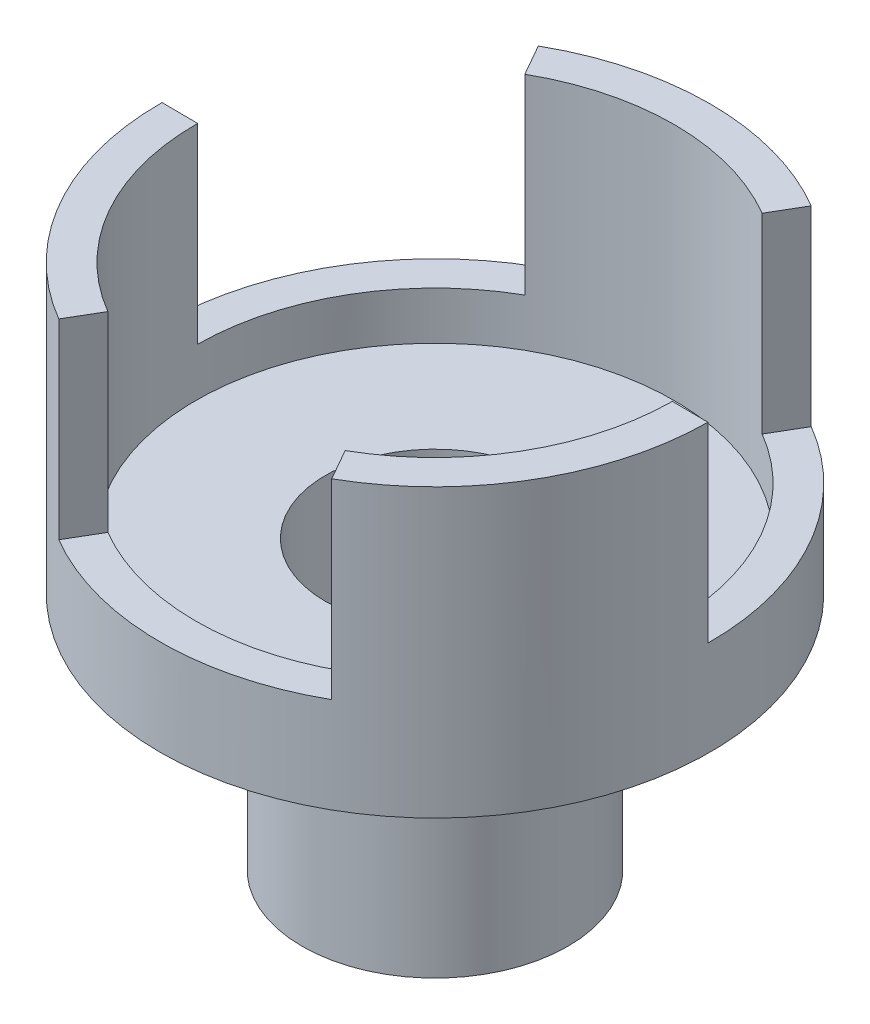
ISO-10303-21;
HEADER;
FILE_DESCRIPTION(('STEP AP214'),'2;1');
FILE_NAME('part.step','',(''),(''),'','','');
FILE_SCHEMA(('AUTOMOTIVE_DESIGN { 1 0 10303 214 1 1 1 1 }'));
ENDSEC;
DATA;
#1=APPLICATION_CONTEXT('core data for automotive mechanical design processes');
#2=APPLICATION_PROTOCOL_DEFINITION('international standard','automotive_design',2000,#1);
#3=PRODUCT_CONTEXT('',#1,'mechanical');
#4=PRODUCT('Part','Part','',(#3));
#5=PRODUCT_RELATED_PRODUCT_CATEGORY('part','',(#4));
#6=PRODUCT_DEFINITION_FORMATION('','',#4);
#7=PRODUCT_DEFINITION_CONTEXT('part definition',#1,'design');
#8=PRODUCT_DEFINITION('design','',#6,#7);
#9=PRODUCT_DEFINITION_SHAPE('','',#8);
#10=(LENGTH_UNIT() NAMED_UNIT(*) SI_UNIT(.MILLI.,.METRE.));
#11=(NAMED_UNIT(*) PLANE_ANGLE_UNIT() SI_UNIT($,.RADIAN.));
#12=(NAMED_UNIT(*) SI_UNIT($,.STERADIAN.) SOLID_ANGLE_UNIT());
#13=UNCERTAINTY_MEASURE_WITH_UNIT(LENGTH_MEASURE(1.E-05),#10,'distance_accuracy_value','');
#14=(GEOMETRIC_REPRESENTATION_CONTEXT(3) GLOBAL_UNCERTAINTY_ASSIGNED_CONTEXT((#13)) GLOBAL_UNIT_ASSIGNED_CONTEXT((#10,
#11,#12)) REPRESENTATION_CONTEXT('',''));
#15=CARTESIAN_POINT('',(0.,0.,0.));
#16=DIRECTION('',(0.,0.,1.));
#17=DIRECTION('',(1.,0.,0.));
#18=AXIS2_PLACEMENT_3D('',#15,#16,#17);
#19=CARTESIAN_POINT('',(0.,10.,0.));
#20=DIRECTION('',(0.,1.,0.));
#21=DIRECTION('',(0.,0.,1.));
#22=AXIS2_PLACEMENT_3D('',#19,#20,#21);
#23=PLANE('',#22);
#24=CARTESIAN_POINT('',(0.,10.,0.));
#25=DIRECTION('',(0.,1.,0.));
#26=DIRECTION('',(0.,0.,1.));
#27=AXIS2_PLACEMENT_3D('',#24,#25,#26);
#28=CIRCLE('',#27,11.5);
#29=CARTESIAN_POINT('',(5.67890834580028,10.,10.));
#30=VERTEX_POINT('',#29);
#31=CARTESIAN_POINT('',(11.4997082107445,10.,0.0819211067736286));
#32=VERTEX_POINT('',#31);
#33=EDGE_CURVE('E12',#30,#32,#28,.T.);
#34=ORIENTED_EDGE('',*,*,#33,.T.);
#35=DIRECTION('',(-0.999974627021263,0.,-0.00712357450205536));
#36=VECTOR('',#35,1.);
#37=CARTESIAN_POINT('',(11.4997082107445,10.,0.0819211067736286));
#38=LINE('',#37,#36);
#39=CARTESIAN_POINT('',(9.99974627021262,10.,0.0712357450205455));
#40=VERTEX_POINT('',#39);
#41=EDGE_CURVE('E217',#32,#40,#38,.T.);
#42=ORIENTED_EDGE('',*,*,#41,.T.);
#43=CARTESIAN_POINT('',(0.,10.,0.));
#44=DIRECTION('',(0.,1.,0.));
#45=DIRECTION('',(0.,0.,1.));
#46=AXIS2_PLACEMENT_3D('',#43,#44,#45);
#47=CIRCLE('',#46,10.);
#48=CARTESIAN_POINT('',(4.93818117026111,10.,8.69565217391304));
#49=VERTEX_POINT('',#48);
#50=EDGE_CURVE('E158',#49,#40,#47,.T.);
#51=ORIENTED_EDGE('',*,*,#50,.F.);
#52=DIRECTION('',(-0.493818117026111,0.,-0.869565217391304));
#53=VECTOR('',#52,1.);
#54=CARTESIAN_POINT('',(5.67890834580028,10.,10.));
#55=LINE('',#54,#53);
#56=EDGE_CURVE('E144',#30,#49,#55,.T.);
#57=ORIENTED_EDGE('',*,*,#56,.F.);
#58=EDGE_LOOP('',(#34,#42,#51,#57));
#59=FACE_BOUND('',#58,.T.);
#60=ADVANCED_FACE('F42',(#59),#23,.T.);
#61=CARTESIAN_POINT('',(-11.4997082107445,10.,-0.0819211067735505));
#62=VERTEX_POINT('',#61);
#63=CARTESIAN_POINT('',(-5.82079986494427,10.,9.91807889322649));
#64=VERTEX_POINT('',#63);
#65=EDGE_CURVE('E51',#62,#64,#28,.T.);
#66=ORIENTED_EDGE('',*,*,#65,.T.);
#67=DIRECTION('',(0.506156509995154,0.,-0.86244164288926));
#68=VECTOR('',#67,1.);
#69=CARTESIAN_POINT('',(-5.82079986494427,10.,9.91807889322649));
#70=LINE('',#69,#68);
#71=CARTESIAN_POINT('',(-5.06156509995154,10.,8.6244164288926));
#72=VERTEX_POINT('',#71);
#73=EDGE_CURVE('E133',#64,#72,#70,.T.);
#74=ORIENTED_EDGE('',*,*,#73,.T.);
#75=CARTESIAN_POINT('',(-9.99974627021263,10.,-0.0712357450204762));
#76=VERTEX_POINT('',#75);
#77=EDGE_CURVE('E163',#76,#72,#47,.T.);
#78=ORIENTED_EDGE('',*,*,#77,.F.);
#79=DIRECTION('',(0.999974627021263,0.,0.00712357450204785));
#80=VECTOR('',#79,1.);
#81=CARTESIAN_POINT('',(-11.4997082107445,10.,-0.0819211067735505));
#82=LINE('',#81,#80);
#83=EDGE_CURVE('E157',#62,#76,#82,.T.);
#84=ORIENTED_EDGE('',*,*,#83,.F.);
#85=EDGE_LOOP('',(#66,#74,#78,#84));
#86=FACE_BOUND('',#85,.T.);
#87=ADVANCED_FACE('F156',(#86),#23,.T.);
#88=DIRECTION('',(-0.50615650999516,0.,0.862441642889256));
#89=VECTOR('',#88,1.);
#90=CARTESIAN_POINT('',(5.82079986494434,10.,-9.91807889322645));
#91=LINE('',#90,#89);
#92=CARTESIAN_POINT('',(5.82079986494434,10.,-9.91807889322645));
#93=VERTEX_POINT('',#92);
#94=CARTESIAN_POINT('',(5.0615650999516,10.,-8.62441642889256));
#95=VERTEX_POINT('',#94);
#96=EDGE_CURVE('E153',#93,#95,#91,.T.);
#97=ORIENTED_EDGE('',*,*,#96,.F.);
#98=CARTESIAN_POINT('',(-5.67890834580021,10.,-10.));
#99=VERTEX_POINT('',#98);
#100=EDGE_CURVE('E50',#93,#99,#28,.T.);
#101=ORIENTED_EDGE('',*,*,#100,.T.);
#102=DIRECTION('',(0.493818117026104,0.,0.869565217391308));
#103=VECTOR('',#102,1.);
#104=CARTESIAN_POINT('',(-5.67890834580021,10.,-10.));
#105=LINE('',#104,#103);
#106=CARTESIAN_POINT('',(-4.93818117026105,10.,-8.69565217391307));
#107=VERTEX_POINT('',#106);
#108=EDGE_CURVE('E202',#99,#107,#105,.T.);
#109=ORIENTED_EDGE('',*,*,#108,.T.);
#110=EDGE_CURVE('E161',#95,#107,#47,.T.);
#111=ORIENTED_EDGE('',*,*,#110,.F.);
#112=EDGE_LOOP('',(#97,#101,#109,#111));
#113=FACE_BOUND('',#112,.T.);
#114=ADVANCED_FACE('F269',(#113),#23,.T.);
#115=CARTESIAN_POINT('',(0.,10.,0.));
#116=DIRECTION('',(0.,-1.,0.));
#117=DIRECTION('',(0.,0.,-1.));
#118=AXIS2_PLACEMENT_3D('',#115,#116,#117);
#119=CYLINDRICAL_SURFACE('',#118,11.5);
#120=CARTESIAN_POINT('',(0.,-2.,0.));
#121=DIRECTION('',(0.,-1.,0.));
#122=DIRECTION('',(0.,0.,-1.));
#123=AXIS2_PLACEMENT_3D('',#120,#121,#122);
#124=CIRCLE('',#123,11.5);
#125=CARTESIAN_POINT('',(0.,-2.,-11.5));
#126=VERTEX_POINT('',#125);
#127=EDGE_CURVE('E177',#126,#126,#124,.T.);
#128=ORIENTED_EDGE('',*,*,#127,.F.);
#129=EDGE_LOOP('',(#128));
#130=FACE_BOUND('',#129,.T.);
#131=DIRECTION('',(0.,1.,0.));
#132=VECTOR('',#131,1.);
#133=CARTESIAN_POINT('',(11.4997082107445,2.,0.0819211067736286));
#134=LINE('',#133,#132);
#135=CARTESIAN_POINT('',(11.4997082107445,2.,0.0819211067736286));
#136=VERTEX_POINT('',#135);
#137=EDGE_CURVE('E227',#136,#32,#134,.T.);
#138=ORIENTED_EDGE('',*,*,#137,.T.);
#139=ORIENTED_EDGE('',*,*,#33,.F.);
#140=DIRECTION('',(0.,1.,0.));
#141=VECTOR('',#140,1.);
#142=CARTESIAN_POINT('',(5.67890834580028,2.,10.));
#143=LINE('',#142,#141);
#144=CARTESIAN_POINT('',(5.67890834580028,2.,10.));
#145=VERTEX_POINT('',#144);
#146=EDGE_CURVE('E241',#145,#30,#143,.T.);
#147=ORIENTED_EDGE('',*,*,#146,.F.);
#148=CARTESIAN_POINT('',(0.,2.,0.));
#149=DIRECTION('',(0.,1.,0.));
#150=DIRECTION('',(0.,0.,1.));
#151=AXIS2_PLACEMENT_3D('',#148,#149,#150);
#152=CIRCLE('',#151,11.5);
#153=CARTESIAN_POINT('',(-5.82079986494427,2.,9.91807889322649));
#154=VERTEX_POINT('',#153);
#155=EDGE_CURVE('E145',#154,#145,#152,.T.);
#156=ORIENTED_EDGE('',*,*,#155,.F.);
#157=DIRECTION('',(0.,1.,0.));
#158=VECTOR('',#157,1.);
#159=CARTESIAN_POINT('',(-5.82079986494427,2.,9.91807889322649));
#160=LINE('',#159,#158);
#161=EDGE_CURVE('E136',#154,#64,#160,.T.);
#162=ORIENTED_EDGE('',*,*,#161,.T.);
#163=ORIENTED_EDGE('',*,*,#65,.F.);
#164=DIRECTION('',(0.,1.,0.));
#165=VECTOR('',#164,1.);
#166=CARTESIAN_POINT('',(-11.4997082107445,2.,-0.0819211067735505));
#167=LINE('',#166,#165);
#168=CARTESIAN_POINT('',(-11.4997082107445,2.,-0.0819211067735505));
#169=VERTEX_POINT('',#168);
#170=EDGE_CURVE('E193',#169,#62,#167,.T.);
#171=ORIENTED_EDGE('',*,*,#170,.F.);
#172=CARTESIAN_POINT('',(0.,2.,0.));
#173=DIRECTION('',(0.,1.,0.));
#174=DIRECTION('',(0.,0.,1.));
#175=AXIS2_PLACEMENT_3D('',#172,#173,#174);
#176=CIRCLE('',#175,11.5);
#177=CARTESIAN_POINT('',(-5.67890834580021,2.,-10.));
#178=VERTEX_POINT('',#177);
#179=EDGE_CURVE('E205',#178,#169,#176,.T.);
#180=ORIENTED_EDGE('',*,*,#179,.F.);
#181=DIRECTION('',(0.,1.,0.));
#182=VECTOR('',#181,1.);
#183=CARTESIAN_POINT('',(-5.67890834580021,2.,-10.));
#184=LINE('',#183,#182);
#185=EDGE_CURVE('E192',#178,#99,#184,.T.);
#186=ORIENTED_EDGE('',*,*,#185,.T.);
#187=ORIENTED_EDGE('',*,*,#100,.F.);
#188=DIRECTION('',(0.,1.,0.));
#189=VECTOR('',#188,1.);
#190=CARTESIAN_POINT('',(5.82079986494434,2.,-9.91807889322645));
#191=LINE('',#190,#189);
#192=CARTESIAN_POINT('',(5.82079986494434,2.,-9.91807889322645));
#193=VERTEX_POINT('',#192);
#194=EDGE_CURVE('E223',#193,#93,#191,.T.);
#195=ORIENTED_EDGE('',*,*,#194,.F.);
#196=CARTESIAN_POINT('',(0.,2.,0.));
#197=DIRECTION('',(0.,1.,0.));
#198=DIRECTION('',(0.,0.,1.));
#199=AXIS2_PLACEMENT_3D('',#196,#197,#198);
#200=CIRCLE('',#199,11.5);
#201=EDGE_CURVE('E215',#136,#193,#200,.T.);
#202=ORIENTED_EDGE('',*,*,#201,.F.);
#203=EDGE_LOOP('',(#138,#139,#147,#156,#162,#163,#171,#180,#186,#187,#195,#202));
#204=FACE_BOUND('',#203,.T.);
#205=ADVANCED_FACE('F44',(#130,#204),#119,.T.);
#206=CARTESIAN_POINT('',(0.,10.,0.));
#207=DIRECTION('',(0.,-1.,0.));
#208=DIRECTION('',(0.,0.,-1.));
#209=AXIS2_PLACEMENT_3D('',#206,#207,#208);
#210=CYLINDRICAL_SURFACE('',#209,10.);
#211=CARTESIAN_POINT('',(0.,0.,0.));
#212=DIRECTION('',(0.,1.,0.));
#213=DIRECTION('',(0.,0.,1.));
#214=AXIS2_PLACEMENT_3D('',#211,#212,#213);
#215=CIRCLE('',#214,10.);
#216=CARTESIAN_POINT('',(0.,0.,10.));
#217=VERTEX_POINT('',#216);
#218=EDGE_CURVE('E170',#217,#217,#215,.T.);
#219=ORIENTED_EDGE('',*,*,#218,.F.);
#220=EDGE_LOOP('',(#219));
#221=FACE_BOUND('',#220,.T.);
#222=ORIENTED_EDGE('',*,*,#50,.T.);
#223=DIRECTION('',(0.,1.,0.));
#224=VECTOR('',#223,1.);
#225=CARTESIAN_POINT('',(9.99974627021262,2.,0.0712357450205455));
#226=LINE('',#225,#224);
#227=CARTESIAN_POINT('',(9.99974627021262,2.,0.0712357450205455));
#228=VERTEX_POINT('',#227);
#229=EDGE_CURVE('E229',#228,#40,#226,.T.);
#230=ORIENTED_EDGE('',*,*,#229,.F.);
#231=CARTESIAN_POINT('',(0.,2.,0.));
#232=DIRECTION('',(0.,-1.,0.));
#233=DIRECTION('',(0.,0.,-1.));
#234=AXIS2_PLACEMENT_3D('',#231,#232,#233);
#235=CIRCLE('',#234,9.99999999999999);
#236=CARTESIAN_POINT('',(5.0615650999516,2.,-8.62441642889256));
#237=VERTEX_POINT('',#236);
#238=EDGE_CURVE('E219',#237,#228,#235,.T.);
#239=ORIENTED_EDGE('',*,*,#238,.F.);
#240=DIRECTION('',(0.,1.,0.));
#241=VECTOR('',#240,1.);
#242=CARTESIAN_POINT('',(5.0615650999516,2.,-8.62441642889256));
#243=LINE('',#242,#241);
#244=EDGE_CURVE('E231',#237,#95,#243,.T.);
#245=ORIENTED_EDGE('',*,*,#244,.T.);
#246=ORIENTED_EDGE('',*,*,#110,.T.);
#247=DIRECTION('',(0.,1.,0.));
#248=VECTOR('',#247,1.);
#249=CARTESIAN_POINT('',(-4.93818117026105,2.,-8.69565217391307));
#250=LINE('',#249,#248);
#251=CARTESIAN_POINT('',(-4.93818117026105,2.,-8.69565217391307));
#252=VERTEX_POINT('',#251);
#253=EDGE_CURVE('E198',#252,#107,#250,.T.);
#254=ORIENTED_EDGE('',*,*,#253,.F.);
#255=CARTESIAN_POINT('',(0.,2.,0.));
#256=DIRECTION('',(0.,-1.,0.));
#257=DIRECTION('',(0.,0.,-1.));
#258=AXIS2_PLACEMENT_3D('',#255,#256,#257);
#259=CIRCLE('',#258,10.);
#260=CARTESIAN_POINT('',(-9.99974627021263,2.,-0.0712357450204762));
#261=VERTEX_POINT('',#260);
#262=EDGE_CURVE('E208',#261,#252,#259,.T.);
#263=ORIENTED_EDGE('',*,*,#262,.F.);
#264=DIRECTION('',(0.,1.,0.));
#265=VECTOR('',#264,1.);
#266=CARTESIAN_POINT('',(-9.99974627021263,2.,-0.0712357450204762));
#267=LINE('',#266,#265);
#268=EDGE_CURVE('E195',#261,#76,#267,.T.);
#269=ORIENTED_EDGE('',*,*,#268,.T.);
#270=ORIENTED_EDGE('',*,*,#77,.T.);
#271=DIRECTION('',(0.,1.,0.));
#272=VECTOR('',#271,1.);
#273=CARTESIAN_POINT('',(-5.06156509995154,2.,8.6244164288926));
#274=LINE('',#273,#272);
#275=CARTESIAN_POINT('',(-5.06156509995154,2.,8.6244164288926));
#276=VERTEX_POINT('',#275);
#277=EDGE_CURVE('E139',#276,#72,#274,.T.);
#278=ORIENTED_EDGE('',*,*,#277,.F.);
#279=CARTESIAN_POINT('',(0.,2.,0.));
#280=DIRECTION('',(0.,-1.,0.));
#281=DIRECTION('',(0.,0.,-1.));
#282=AXIS2_PLACEMENT_3D('',#279,#280,#281);
#283=CIRCLE('',#282,9.99999999999999);
#284=CARTESIAN_POINT('',(4.93818117026111,2.,8.69565217391304));
#285=VERTEX_POINT('',#284);
#286=EDGE_CURVE('E237',#285,#276,#283,.T.);
#287=ORIENTED_EDGE('',*,*,#286,.F.);
#288=DIRECTION('',(0.,1.,0.));
#289=VECTOR('',#288,1.);
#290=CARTESIAN_POINT('',(4.93818117026111,2.,8.69565217391304));
#291=LINE('',#290,#289);
#292=EDGE_CURVE('E244',#285,#49,#291,.T.);
#293=ORIENTED_EDGE('',*,*,#292,.T.);
#294=EDGE_LOOP('',(#222,#230,#239,#245,#246,#254,#263,#269,#270,#278,#287,#293));
#295=FACE_BOUND('',#294,.T.);
#296=ADVANCED_FACE('F258',(#221,#295),#210,.F.);
#297=CARTESIAN_POINT('',(0.,0.,0.));
#298=DIRECTION('',(0.,-1.,0.));
#299=DIRECTION('',(0.,0.,-1.));
#300=AXIS2_PLACEMENT_3D('',#297,#298,#299);
#301=PLANE('',#300);
#302=ORIENTED_EDGE('',*,*,#218,.T.);
#303=EDGE_LOOP('',(#302));
#304=FACE_BOUND('',#303,.T.);
#305=CARTESIAN_POINT('',(0.,0.,0.));
#306=DIRECTION('',(0.,-1.,0.));
#307=DIRECTION('',(0.,0.,-1.));
#308=AXIS2_PLACEMENT_3D('',#305,#306,#307);
#309=CIRCLE('',#308,4.57574343616161);
#310=CARTESIAN_POINT('',(0.,0.,-4.57574343616161));
#311=VERTEX_POINT('',#310);
#312=EDGE_CURVE('E181',#311,#311,#309,.T.);
#313=ORIENTED_EDGE('',*,*,#312,.T.);
#314=EDGE_LOOP('',(#313));
#315=FACE_BOUND('',#314,.T.);
#316=ADVANCED_FACE('F260',(#304,#315),#301,.F.);
#317=CARTESIAN_POINT('',(0.,-2.,0.));
#318=DIRECTION('',(0.,-1.,0.));
#319=DIRECTION('',(0.,0.,-1.));
#320=AXIS2_PLACEMENT_3D('',#317,#318,#319);
#321=PLANE('',#320);
#322=ORIENTED_EDGE('',*,*,#127,.T.);
#323=EDGE_LOOP('',(#322));
#324=FACE_BOUND('',#323,.T.);
#325=CARTESIAN_POINT('',(0.,-2.,0.));
#326=DIRECTION('',(0.,-1.,0.));
#327=DIRECTION('',(0.,0.,-1.));
#328=AXIS2_PLACEMENT_3D('',#325,#326,#327);
#329=CIRCLE('',#328,5.55837658601341);
#330=CARTESIAN_POINT('',(0.,-2.,-5.55837658601341));
#331=VERTEX_POINT('',#330);
#332=EDGE_CURVE('E173',#331,#331,#329,.T.);
#333=ORIENTED_EDGE('',*,*,#332,.F.);
#334=EDGE_LOOP('',(#333));
#335=FACE_BOUND('',#334,.T.);
#336=ADVANCED_FACE('F267',(#324,#335),#321,.T.);
#337=CARTESIAN_POINT('',(0.,-10.,0.));
#338=DIRECTION('',(0.,1.,0.));
#339=DIRECTION('',(0.,0.,1.));
#340=AXIS2_PLACEMENT_3D('',#337,#338,#339);
#341=CYLINDRICAL_SURFACE('',#340,4.57574343616161);
#342=CARTESIAN_POINT('',(0.,-10.,0.));
#343=DIRECTION('',(0.,-1.,0.));
#344=DIRECTION('',(0.,0.,-1.));
#345=AXIS2_PLACEMENT_3D('',#342,#343,#344);
#346=CIRCLE('',#345,4.57574343616161);
#347=CARTESIAN_POINT('',(0.,-10.,-4.57574343616161));
#348=VERTEX_POINT('',#347);
#349=EDGE_CURVE('E186',#348,#348,#346,.T.);
#350=ORIENTED_EDGE('',*,*,#349,.T.);
#351=EDGE_LOOP('',(#350));
#352=FACE_BOUND('',#351,.T.);
#353=ORIENTED_EDGE('',*,*,#312,.F.);
#354=EDGE_LOOP('',(#353));
#355=FACE_BOUND('',#354,.T.);
#356=ADVANCED_FACE('F324',(#352,#355),#341,.F.);
#357=CARTESIAN_POINT('',(0.,-10.,0.));
#358=DIRECTION('',(0.,1.,0.));
#359=DIRECTION('',(0.,0.,1.));
#360=AXIS2_PLACEMENT_3D('',#357,#358,#359);
#361=CYLINDRICAL_SURFACE('',#360,5.55837658601341);
#362=ORIENTED_EDGE('',*,*,#332,.T.);
#363=EDGE_LOOP('',(#362));
#364=FACE_BOUND('',#363,.T.);
#365=CARTESIAN_POINT('',(0.,-12.,0.));
#366=DIRECTION('',(0.,-1.,0.));
#367=DIRECTION('',(0.,0.,-1.));
#368=AXIS2_PLACEMENT_3D('',#365,#366,#367);
#369=CIRCLE('',#368,5.55837658601341);
#370=CARTESIAN_POINT('',(0.,-12.,-5.55837658601341));
#371=VERTEX_POINT('',#370);
#372=EDGE_CURVE('E189',#371,#371,#369,.T.);
#373=ORIENTED_EDGE('',*,*,#372,.F.);
#374=EDGE_LOOP('',(#373));
#375=FACE_BOUND('',#374,.T.);
#376=ADVANCED_FACE('F320',(#364,#375),#361,.T.);
#377=CARTESIAN_POINT('',(0.,-10.,0.));
#378=DIRECTION('',(0.,-1.,0.));
#379=DIRECTION('',(0.,0.,-1.));
#380=AXIS2_PLACEMENT_3D('',#377,#378,#379);
#381=PLANE('',#380);
#382=ORIENTED_EDGE('',*,*,#349,.F.);
#383=EDGE_LOOP('',(#382));
#384=FACE_BOUND('',#383,.T.);
#385=ADVANCED_FACE('F316',(#384),#381,.F.);
#386=CARTESIAN_POINT('',(0.,-12.,0.));
#387=DIRECTION('',(0.,-1.,0.));
#388=DIRECTION('',(0.,0.,-1.));
#389=AXIS2_PLACEMENT_3D('',#386,#387,#388);
#390=PLANE('',#389);
#391=ORIENTED_EDGE('',*,*,#372,.T.);
#392=EDGE_LOOP('',(#391));
#393=FACE_BOUND('',#392,.T.);
#394=ADVANCED_FACE('F310',(#393),#390,.T.);
#395=CARTESIAN_POINT('',(-5.67890834580021,2.,-10.));
#396=DIRECTION('',(-0.869565217391308,0.,0.493818117026105));
#397=DIRECTION('',(0.493818117026104,0.,0.869565217391308));
#398=AXIS2_PLACEMENT_3D('',#395,#396,#397);
#399=PLANE('',#398);
#400=ORIENTED_EDGE('',*,*,#108,.F.);
#401=ORIENTED_EDGE('',*,*,#185,.F.);
#402=DIRECTION('',(0.493818117026104,0.,0.869565217391308));
#403=VECTOR('',#402,1.);
#404=CARTESIAN_POINT('',(-5.67890834580021,2.,-10.));
#405=LINE('',#404,#403);
#406=EDGE_CURVE('E196',#178,#252,#405,.T.);
#407=ORIENTED_EDGE('',*,*,#406,.T.);
#408=ORIENTED_EDGE('',*,*,#253,.T.);
#409=EDGE_LOOP('',(#400,#401,#407,#408));
#410=FACE_BOUND('',#409,.T.);
#411=ADVANCED_FACE('F286',(#410),#399,.T.);
#412=CARTESIAN_POINT('',(-11.4997082107445,2.,-0.0819211067735505));
#413=DIRECTION('',(-0.00712357450204785,0.,0.999974627021263));
#414=DIRECTION('',(0.999974627021263,0.,0.00712357450204785));
#415=AXIS2_PLACEMENT_3D('',#412,#413,#414);
#416=PLANE('',#415);
#417=ORIENTED_EDGE('',*,*,#83,.T.);
#418=ORIENTED_EDGE('',*,*,#268,.F.);
#419=DIRECTION('',(0.999974627021263,0.,0.00712357450204785));
#420=VECTOR('',#419,1.);
#421=CARTESIAN_POINT('',(-11.4997082107445,2.,-0.0819211067735505));
#422=LINE('',#421,#420);
#423=EDGE_CURVE('E211',#169,#261,#422,.T.);
#424=ORIENTED_EDGE('',*,*,#423,.F.);
#425=ORIENTED_EDGE('',*,*,#170,.T.);
#426=EDGE_LOOP('',(#417,#418,#424,#425));
#427=FACE_BOUND('',#426,.T.);
#428=ADVANCED_FACE('F307',(#427),#416,.F.);
#429=CARTESIAN_POINT('',(0.,2.,0.));
#430=DIRECTION('',(0.,1.,0.));
#431=DIRECTION('',(0.,0.,1.));
#432=AXIS2_PLACEMENT_3D('',#429,#430,#431);
#433=PLANE('',#432);
#434=ORIENTED_EDGE('',*,*,#179,.T.);
#435=ORIENTED_EDGE('',*,*,#423,.T.);
#436=ORIENTED_EDGE('',*,*,#262,.T.);
#437=ORIENTED_EDGE('',*,*,#406,.F.);
#438=EDGE_LOOP('',(#434,#435,#436,#437));
#439=FACE_BOUND('',#438,.T.);
#440=ADVANCED_FACE('F288',(#439),#433,.T.);
#441=CARTESIAN_POINT('',(-5.82079986494427,2.,9.91807889322649));
#442=DIRECTION('',(0.86244164288926,0.,0.506156509995154));
#443=DIRECTION('',(0.506156509995154,0.,-0.86244164288926));
#444=AXIS2_PLACEMENT_3D('',#441,#442,#443);
#445=PLANE('',#444);
#446=ORIENTED_EDGE('',*,*,#73,.F.);
#447=ORIENTED_EDGE('',*,*,#161,.F.);
#448=DIRECTION('',(0.506156509995154,0.,-0.86244164288926));
#449=VECTOR('',#448,1.);
#450=CARTESIAN_POINT('',(-5.82079986494427,2.,9.91807889322649));
#451=LINE('',#450,#449);
#452=EDGE_CURVE('E239',#154,#276,#451,.T.);
#453=ORIENTED_EDGE('',*,*,#452,.T.);
#454=ORIENTED_EDGE('',*,*,#277,.T.);
#455=EDGE_LOOP('',(#446,#447,#453,#454));
#456=FACE_BOUND('',#455,.T.);
#457=ADVANCED_FACE('F135',(#456),#445,.T.);
#458=CARTESIAN_POINT('',(5.67890834580028,2.,10.));
#459=DIRECTION('',(0.869565217391304,0.,-0.493818117026111));
#460=DIRECTION('',(-0.493818117026111,0.,-0.869565217391304));
#461=AXIS2_PLACEMENT_3D('',#458,#459,#460);
#462=PLANE('',#461);
#463=ORIENTED_EDGE('',*,*,#56,.T.);
#464=ORIENTED_EDGE('',*,*,#292,.F.);
#465=DIRECTION('',(-0.493818117026111,0.,-0.869565217391304));
#466=VECTOR('',#465,1.);
#467=CARTESIAN_POINT('',(5.67890834580028,2.,10.));
#468=LINE('',#467,#466);
#469=EDGE_CURVE('E66',#145,#285,#468,.T.);
#470=ORIENTED_EDGE('',*,*,#469,.F.);
#471=ORIENTED_EDGE('',*,*,#146,.T.);
#472=EDGE_LOOP('',(#463,#464,#470,#471));
#473=FACE_BOUND('',#472,.T.);
#474=ADVANCED_FACE('F248',(#473),#462,.F.);
#475=CARTESIAN_POINT('',(0.,2.,0.));
#476=DIRECTION('',(0.,1.,0.));
#477=DIRECTION('',(0.,0.,1.));
#478=AXIS2_PLACEMENT_3D('',#475,#476,#477);
#479=PLANE('',#478);
#480=ORIENTED_EDGE('',*,*,#155,.T.);
#481=ORIENTED_EDGE('',*,*,#469,.T.);
#482=ORIENTED_EDGE('',*,*,#286,.T.);
#483=ORIENTED_EDGE('',*,*,#452,.F.);
#484=EDGE_LOOP('',(#480,#481,#482,#483));
#485=FACE_BOUND('',#484,.T.);
#486=ADVANCED_FACE('F300',(#485),#479,.T.);
#487=CARTESIAN_POINT('',(11.4997082107445,2.,0.0819211067736286));
#488=DIRECTION('',(0.00712357450205536,0.,-0.999974627021263));
#489=DIRECTION('',(-0.999974627021263,0.,-0.00712357450205536));
#490=AXIS2_PLACEMENT_3D('',#487,#488,#489);
#491=PLANE('',#490);
#492=ORIENTED_EDGE('',*,*,#41,.F.);
#493=ORIENTED_EDGE('',*,*,#137,.F.);
#494=DIRECTION('',(-0.999974627021263,0.,-0.00712357450205536));
#495=VECTOR('',#494,1.);
#496=CARTESIAN_POINT('',(11.4997082107445,2.,0.0819211067736286));
#497=LINE('',#496,#495);
#498=EDGE_CURVE('E221',#136,#228,#497,.T.);
#499=ORIENTED_EDGE('',*,*,#498,.T.);
#500=ORIENTED_EDGE('',*,*,#229,.T.);
#501=EDGE_LOOP('',(#492,#493,#499,#500));
#502=FACE_BOUND('',#501,.T.);
#503=ADVANCED_FACE('F255',(#502),#491,.T.);
#504=CARTESIAN_POINT('',(5.82079986494434,2.,-9.91807889322645));
#505=DIRECTION('',(-0.862441642889257,0.,-0.50615650999516));
#506=DIRECTION('',(-0.50615650999516,0.,0.862441642889257));
#507=AXIS2_PLACEMENT_3D('',#504,#505,#506);
#508=PLANE('',#507);
#509=ORIENTED_EDGE('',*,*,#96,.T.);
#510=ORIENTED_EDGE('',*,*,#244,.F.);
#511=DIRECTION('',(-0.50615650999516,0.,0.862441642889256));
#512=VECTOR('',#511,1.);
#513=CARTESIAN_POINT('',(5.82079986494434,2.,-9.91807889322645));
#514=LINE('',#513,#512);
#515=EDGE_CURVE('E58',#193,#237,#514,.T.);
#516=ORIENTED_EDGE('',*,*,#515,.F.);
#517=ORIENTED_EDGE('',*,*,#194,.T.);
#518=EDGE_LOOP('',(#509,#510,#516,#517));
#519=FACE_BOUND('',#518,.T.);
#520=ADVANCED_FACE('F292',(#519),#508,.F.);
#521=CARTESIAN_POINT('',(0.,2.,0.));
#522=DIRECTION('',(0.,1.,0.));
#523=DIRECTION('',(0.,0.,1.));
#524=AXIS2_PLACEMENT_3D('',#521,#522,#523);
#525=PLANE('',#524);
#526=ORIENTED_EDGE('',*,*,#201,.T.);
#527=ORIENTED_EDGE('',*,*,#515,.T.);
#528=ORIENTED_EDGE('',*,*,#238,.T.);
#529=ORIENTED_EDGE('',*,*,#498,.F.);
#530=EDGE_LOOP('',(#526,#527,#528,#529));
#531=FACE_BOUND('',#530,.T.);
#532=ADVANCED_FACE('F256',(#531),#525,.T.);
#533=CLOSED_SHELL('',(#60,#87,#114,#205,#296,#316,#336,#356,#376,#385,#394,#411,#428,#440,#457,
#474,#486,#503,#520,#532));
#534=MANIFOLD_SOLID_BREP('B2',#533);
#535=ADVANCED_BREP_SHAPE_REPRESENTATION('',(#18,#534),#14);
#536=SHAPE_DEFINITION_REPRESENTATION(#9,#535);
ENDSEC;
END-ISO-10303-21;
